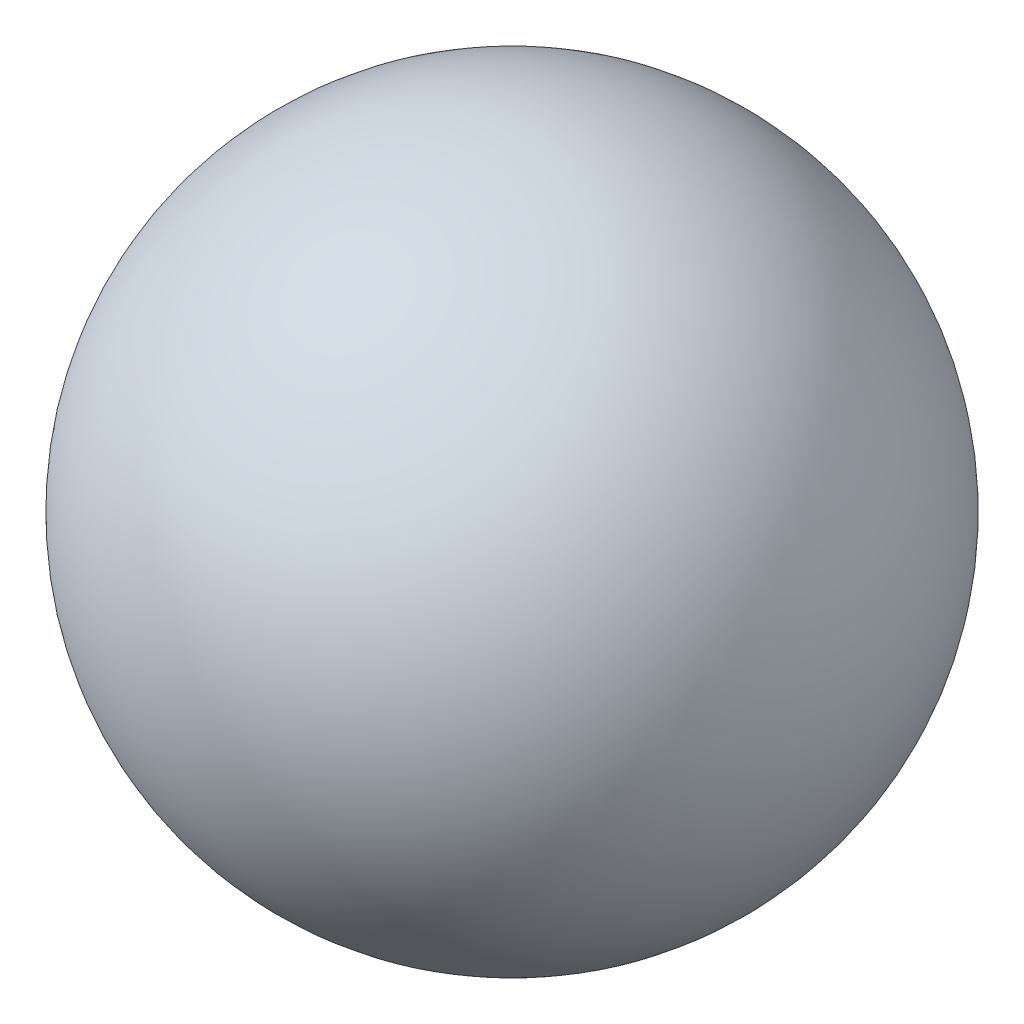
ISO-10303-21;
HEADER;
FILE_DESCRIPTION(('STEP AP214'),'2;1');
FILE_NAME('part.step','',(''),(''),'','','');
FILE_SCHEMA(('AUTOMOTIVE_DESIGN { 1 0 10303 214 1 1 1 1 }'));
ENDSEC;
DATA;
#1=APPLICATION_CONTEXT('core data for automotive mechanical design processes');
#2=APPLICATION_PROTOCOL_DEFINITION('international standard','automotive_design',2000,#1);
#3=PRODUCT_CONTEXT('',#1,'mechanical');
#4=PRODUCT('Part','Part','',(#3));
#5=PRODUCT_RELATED_PRODUCT_CATEGORY('part','',(#4));
#6=PRODUCT_DEFINITION_FORMATION('','',#4);
#7=PRODUCT_DEFINITION_CONTEXT('part definition',#1,'design');
#8=PRODUCT_DEFINITION('design','',#6,#7);
#9=PRODUCT_DEFINITION_SHAPE('','',#8);
#10=(LENGTH_UNIT() NAMED_UNIT(*) SI_UNIT(.MILLI.,.METRE.));
#11=(NAMED_UNIT(*) PLANE_ANGLE_UNIT() SI_UNIT($,.RADIAN.));
#12=(NAMED_UNIT(*) SI_UNIT($,.STERADIAN.) SOLID_ANGLE_UNIT());
#13=UNCERTAINTY_MEASURE_WITH_UNIT(LENGTH_MEASURE(1.E-05),#10,'distance_accuracy_value','');
#14=(GEOMETRIC_REPRESENTATION_CONTEXT(3) GLOBAL_UNCERTAINTY_ASSIGNED_CONTEXT((#13)) GLOBAL_UNIT_ASSIGNED_CONTEXT((#10,
#11,#12)) REPRESENTATION_CONTEXT('',''));
#15=CARTESIAN_POINT('',(0.,0.,0.));
#16=DIRECTION('',(0.,0.,1.));
#17=DIRECTION('',(1.,0.,0.));
#18=AXIS2_PLACEMENT_3D('',#15,#16,#17);
#19=CARTESIAN_POINT('',(0.,0.,0.));
#20=DIRECTION('',(0.,1.,0.));
#21=DIRECTION('',(1.,0.,0.));
#22=AXIS2_PLACEMENT_3D('',#19,#20,#21);
#23=SPHERICAL_SURFACE('',#22,4.);
#24=CARTESIAN_POINT('',(0.,4.,0.));
#25=VERTEX_POINT('',#24);
#26=VERTEX_LOOP('',#25);
#27=FACE_BOUND('',#26,.T.);
#28=ADVANCED_FACE('F33',(#27),#23,.T.);
#29=CLOSED_SHELL('',(#28));
#30=MANIFOLD_SOLID_BREP('B2',#29);
#31=ADVANCED_BREP_SHAPE_REPRESENTATION('',(#18,#30),#14);
#32=SHAPE_DEFINITION_REPRESENTATION(#9,#31);
ENDSEC;
END-ISO-10303-21;
